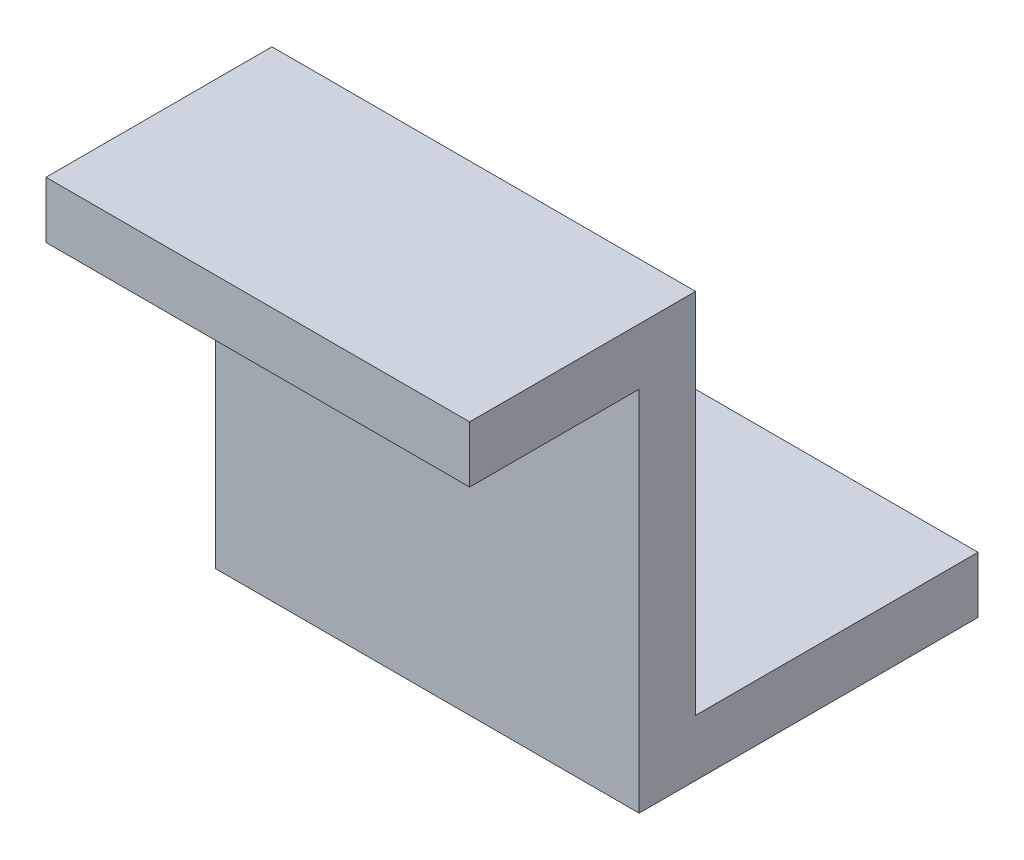
ISO-10303-21;
HEADER;
FILE_DESCRIPTION(('STEP AP214'),'2;1');
FILE_NAME('part.step','',(''),(''),'','','');
FILE_SCHEMA(('AUTOMOTIVE_DESIGN { 1 0 10303 214 1 1 1 1 }'));
ENDSEC;
DATA;
#1=APPLICATION_CONTEXT('core data for automotive mechanical design processes');
#2=APPLICATION_PROTOCOL_DEFINITION('international standard','automotive_design',2000,#1);
#3=PRODUCT_CONTEXT('',#1,'mechanical');
#4=PRODUCT('Part','Part','',(#3));
#5=PRODUCT_RELATED_PRODUCT_CATEGORY('part','',(#4));
#6=PRODUCT_DEFINITION_FORMATION('','',#4);
#7=PRODUCT_DEFINITION_CONTEXT('part definition',#1,'design');
#8=PRODUCT_DEFINITION('design','',#6,#7);
#9=PRODUCT_DEFINITION_SHAPE('','',#8);
#10=(LENGTH_UNIT() NAMED_UNIT(*) SI_UNIT(.MILLI.,.METRE.));
#11=(NAMED_UNIT(*) PLANE_ANGLE_UNIT() SI_UNIT($,.RADIAN.));
#12=(NAMED_UNIT(*) SI_UNIT($,.STERADIAN.) SOLID_ANGLE_UNIT());
#13=UNCERTAINTY_MEASURE_WITH_UNIT(LENGTH_MEASURE(1.E-05),#10,'distance_accuracy_value','');
#14=(GEOMETRIC_REPRESENTATION_CONTEXT(3) GLOBAL_UNCERTAINTY_ASSIGNED_CONTEXT((#13)) GLOBAL_UNIT_ASSIGNED_CONTEXT((#10,
#11,#12)) REPRESENTATION_CONTEXT('',''));
#15=CARTESIAN_POINT('',(0.,0.,0.));
#16=DIRECTION('',(0.,0.,1.));
#17=DIRECTION('',(1.,0.,0.));
#18=AXIS2_PLACEMENT_3D('',#15,#16,#17);
#19=CARTESIAN_POINT('',(-15.,-2.,0.));
#20=DIRECTION('',(0.,0.,1.));
#21=DIRECTION('',(1.,0.,0.));
#22=AXIS2_PLACEMENT_3D('',#19,#20,#21);
#23=PLANE('',#22);
#24=DIRECTION('',(0.,-1.,0.));
#25=VECTOR('',#24,1.);
#26=CARTESIAN_POINT('',(0.,-2.,0.));
#27=LINE('',#26,#25);
#28=CARTESIAN_POINT('',(0.,0.,0.));
#29=VERTEX_POINT('',#28);
#30=CARTESIAN_POINT('',(0.,-2.,0.));
#31=VERTEX_POINT('',#30);
#32=EDGE_CURVE('E130',#29,#31,#27,.T.);
#33=ORIENTED_EDGE('',*,*,#32,.F.);
#34=DIRECTION('',(1.,0.,0.));
#35=VECTOR('',#34,1.);
#36=CARTESIAN_POINT('',(-15.,0.,0.));
#37=LINE('',#36,#35);
#38=CARTESIAN_POINT('',(-15.,0.,0.));
#39=VERTEX_POINT('',#38);
#40=EDGE_CURVE('E11',#39,#29,#37,.T.);
#41=ORIENTED_EDGE('',*,*,#40,.F.);
#42=DIRECTION('',(0.,-1.,0.));
#43=VECTOR('',#42,1.);
#44=CARTESIAN_POINT('',(-15.,-2.,0.));
#45=LINE('',#44,#43);
#46=CARTESIAN_POINT('',(-15.,-2.,0.));
#47=VERTEX_POINT('',#46);
#48=EDGE_CURVE('E151',#39,#47,#45,.T.);
#49=ORIENTED_EDGE('',*,*,#48,.T.);
#50=DIRECTION('',(1.,0.,0.));
#51=VECTOR('',#50,1.);
#52=CARTESIAN_POINT('',(-15.,-2.,0.));
#53=LINE('',#52,#51);
#54=EDGE_CURVE('E36',#47,#31,#53,.T.);
#55=ORIENTED_EDGE('',*,*,#54,.T.);
#56=EDGE_LOOP('',(#33,#41,#49,#55));
#57=FACE_BOUND('',#56,.T.);
#58=ADVANCED_FACE('F33',(#57),#23,.T.);
#59=CARTESIAN_POINT('',(-15.,0.,0.));
#60=DIRECTION('',(0.,1.,0.));
#61=DIRECTION('',(0.,0.,1.));
#62=AXIS2_PLACEMENT_3D('',#59,#60,#61);
#63=PLANE('',#62);
#64=DIRECTION('',(0.,0.,1.));
#65=VECTOR('',#64,1.);
#66=CARTESIAN_POINT('',(0.,0.,0.));
#67=LINE('',#66,#65);
#68=CARTESIAN_POINT('',(0.,0.,-8.));
#69=VERTEX_POINT('',#68);
#70=EDGE_CURVE('E149',#69,#29,#67,.T.);
#71=ORIENTED_EDGE('',*,*,#70,.F.);
#72=DIRECTION('',(1.,0.,0.));
#73=VECTOR('',#72,1.);
#74=CARTESIAN_POINT('',(-15.,0.,-8.));
#75=LINE('',#74,#73);
#76=CARTESIAN_POINT('',(-15.,0.,-8.));
#77=VERTEX_POINT('',#76);
#78=EDGE_CURVE('E42',#77,#69,#75,.T.);
#79=ORIENTED_EDGE('',*,*,#78,.F.);
#80=DIRECTION('',(0.,0.,1.));
#81=VECTOR('',#80,1.);
#82=CARTESIAN_POINT('',(-15.,0.,0.));
#83=LINE('',#82,#81);
#84=EDGE_CURVE('E120',#77,#39,#83,.T.);
#85=ORIENTED_EDGE('',*,*,#84,.T.);
#86=ORIENTED_EDGE('',*,*,#40,.T.);
#87=EDGE_LOOP('',(#71,#79,#85,#86));
#88=FACE_BOUND('',#87,.T.);
#89=ADVANCED_FACE('F163',(#88),#63,.T.);
#90=CARTESIAN_POINT('',(-15.,0.,-8.));
#91=DIRECTION('',(0.,0.,-1.));
#92=DIRECTION('',(0.,1.,0.));
#93=AXIS2_PLACEMENT_3D('',#90,#91,#92);
#94=PLANE('',#93);
#95=DIRECTION('',(0.,1.,0.));
#96=VECTOR('',#95,1.);
#97=CARTESIAN_POINT('',(0.,0.,-8.));
#98=LINE('',#97,#96);
#99=CARTESIAN_POINT('',(0.,-13.,-8.));
#100=VERTEX_POINT('',#99);
#101=EDGE_CURVE('E107',#100,#69,#98,.T.);
#102=ORIENTED_EDGE('',*,*,#101,.F.);
#103=DIRECTION('',(1.,0.,0.));
#104=VECTOR('',#103,1.);
#105=CARTESIAN_POINT('',(-15.,-13.,-8.));
#106=LINE('',#105,#104);
#107=CARTESIAN_POINT('',(-15.,-13.,-8.));
#108=VERTEX_POINT('',#107);
#109=EDGE_CURVE('E102',#108,#100,#106,.T.);
#110=ORIENTED_EDGE('',*,*,#109,.F.);
#111=DIRECTION('',(0.,1.,0.));
#112=VECTOR('',#111,1.);
#113=CARTESIAN_POINT('',(-15.,0.,-8.));
#114=LINE('',#113,#112);
#115=EDGE_CURVE('E105',#108,#77,#114,.T.);
#116=ORIENTED_EDGE('',*,*,#115,.T.);
#117=ORIENTED_EDGE('',*,*,#78,.T.);
#118=EDGE_LOOP('',(#102,#110,#116,#117));
#119=FACE_BOUND('',#118,.T.);
#120=ADVANCED_FACE('F104',(#119),#94,.T.);
#121=CARTESIAN_POINT('',(-15.,-13.,-8.));
#122=DIRECTION('',(0.,1.,0.));
#123=DIRECTION('',(0.,0.,1.));
#124=AXIS2_PLACEMENT_3D('',#121,#122,#123);
#125=PLANE('',#124);
#126=CARTESIAN_POINT('',(-7.5,-13.,-13.));
#127=DIRECTION('',(0.,1.,0.));
#128=DIRECTION('',(0.,0.,1.));
#129=AXIS2_PLACEMENT_3D('',#126,#127,#128);
#130=CIRCLE('',#129,1.5);
#131=CARTESIAN_POINT('',(-7.5,-13.,-11.5));
#132=VERTEX_POINT('',#131);
#133=EDGE_CURVE('E134',#132,#132,#130,.T.);
#134=ORIENTED_EDGE('',*,*,#133,.F.);
#135=EDGE_LOOP('',(#134));
#136=FACE_BOUND('',#135,.T.);
#137=DIRECTION('',(0.,0.,1.));
#138=VECTOR('',#137,1.);
#139=CARTESIAN_POINT('',(0.,-13.,-8.));
#140=LINE('',#139,#138);
#141=CARTESIAN_POINT('',(0.,-13.,-18.));
#142=VERTEX_POINT('',#141);
#143=EDGE_CURVE('E146',#142,#100,#140,.T.);
#144=ORIENTED_EDGE('',*,*,#143,.F.);
#145=DIRECTION('',(1.,0.,0.));
#146=VECTOR('',#145,1.);
#147=CARTESIAN_POINT('',(-15.,-13.,-18.));
#148=LINE('',#147,#146);
#149=CARTESIAN_POINT('',(-15.,-13.,-18.));
#150=VERTEX_POINT('',#149);
#151=EDGE_CURVE('E112',#150,#142,#148,.T.);
#152=ORIENTED_EDGE('',*,*,#151,.F.);
#153=DIRECTION('',(0.,0.,1.));
#154=VECTOR('',#153,1.);
#155=CARTESIAN_POINT('',(-15.,-13.,-8.));
#156=LINE('',#155,#154);
#157=EDGE_CURVE('E118',#150,#108,#156,.T.);
#158=ORIENTED_EDGE('',*,*,#157,.T.);
#159=ORIENTED_EDGE('',*,*,#109,.T.);
#160=EDGE_LOOP('',(#144,#152,#158,#159));
#161=FACE_BOUND('',#160,.T.);
#162=ADVANCED_FACE('F122',(#136,#161),#125,.T.);
#163=CARTESIAN_POINT('',(-15.,-13.,-18.));
#164=DIRECTION('',(0.,0.,-1.));
#165=DIRECTION('',(-1.,0.,0.));
#166=AXIS2_PLACEMENT_3D('',#163,#164,#165);
#167=PLANE('',#166);
#168=DIRECTION('',(0.,1.,0.));
#169=VECTOR('',#168,1.);
#170=CARTESIAN_POINT('',(0.,-13.,-18.));
#171=LINE('',#170,#169);
#172=CARTESIAN_POINT('',(0.,-15.,-18.));
#173=VERTEX_POINT('',#172);
#174=EDGE_CURVE('E143',#173,#142,#171,.T.);
#175=ORIENTED_EDGE('',*,*,#174,.F.);
#176=DIRECTION('',(1.,0.,0.));
#177=VECTOR('',#176,1.);
#178=CARTESIAN_POINT('',(-15.,-15.,-18.));
#179=LINE('',#178,#177);
#180=CARTESIAN_POINT('',(-15.,-15.,-18.));
#181=VERTEX_POINT('',#180);
#182=EDGE_CURVE('E155',#181,#173,#179,.T.);
#183=ORIENTED_EDGE('',*,*,#182,.F.);
#184=DIRECTION('',(0.,1.,0.));
#185=VECTOR('',#184,1.);
#186=CARTESIAN_POINT('',(-15.,-13.,-18.));
#187=LINE('',#186,#185);
#188=EDGE_CURVE('E123',#181,#150,#187,.T.);
#189=ORIENTED_EDGE('',*,*,#188,.T.);
#190=ORIENTED_EDGE('',*,*,#151,.T.);
#191=EDGE_LOOP('',(#175,#183,#189,#190));
#192=FACE_BOUND('',#191,.T.);
#193=ADVANCED_FACE('F176',(#192),#167,.T.);
#194=CARTESIAN_POINT('',(-15.,-15.,-18.));
#195=DIRECTION('',(0.,-1.,0.));
#196=DIRECTION('',(0.,0.,-1.));
#197=AXIS2_PLACEMENT_3D('',#194,#195,#196);
#198=PLANE('',#197);
#199=CARTESIAN_POINT('',(-7.5,-15.,-13.));
#200=DIRECTION('',(0.,-1.,0.));
#201=DIRECTION('',(0.,0.,-1.));
#202=AXIS2_PLACEMENT_3D('',#199,#200,#201);
#203=CIRCLE('',#202,1.5);
#204=CARTESIAN_POINT('',(-7.5,-15.,-14.5));
#205=VERTEX_POINT('',#204);
#206=EDGE_CURVE('E204',#205,#205,#203,.F.);
#207=ORIENTED_EDGE('',*,*,#206,.T.);
#208=EDGE_LOOP('',(#207));
#209=FACE_BOUND('',#208,.T.);
#210=DIRECTION('',(0.,0.,-1.));
#211=VECTOR('',#210,1.);
#212=CARTESIAN_POINT('',(0.,-15.,-18.));
#213=LINE('',#212,#211);
#214=CARTESIAN_POINT('',(0.,-15.,-6.));
#215=VERTEX_POINT('',#214);
#216=EDGE_CURVE('E140',#215,#173,#213,.T.);
#217=ORIENTED_EDGE('',*,*,#216,.F.);
#218=DIRECTION('',(1.,0.,0.));
#219=VECTOR('',#218,1.);
#220=CARTESIAN_POINT('',(-15.,-15.,-6.));
#221=LINE('',#220,#219);
#222=CARTESIAN_POINT('',(-15.,-15.,-6.));
#223=VERTEX_POINT('',#222);
#224=EDGE_CURVE('E157',#223,#215,#221,.T.);
#225=ORIENTED_EDGE('',*,*,#224,.F.);
#226=DIRECTION('',(0.,0.,-1.));
#227=VECTOR('',#226,1.);
#228=CARTESIAN_POINT('',(-15.,-15.,-18.));
#229=LINE('',#228,#227);
#230=EDGE_CURVE('E125',#223,#181,#229,.T.);
#231=ORIENTED_EDGE('',*,*,#230,.T.);
#232=ORIENTED_EDGE('',*,*,#182,.T.);
#233=EDGE_LOOP('',(#217,#225,#231,#232));
#234=FACE_BOUND('',#233,.T.);
#235=ADVANCED_FACE('F180',(#209,#234),#198,.T.);
#236=CARTESIAN_POINT('',(-15.,-15.,-6.));
#237=DIRECTION('',(0.,0.,1.));
#238=DIRECTION('',(1.,0.,0.));
#239=AXIS2_PLACEMENT_3D('',#236,#237,#238);
#240=PLANE('',#239);
#241=DIRECTION('',(0.,-1.,0.));
#242=VECTOR('',#241,1.);
#243=CARTESIAN_POINT('',(0.,-15.,-6.));
#244=LINE('',#243,#242);
#245=CARTESIAN_POINT('',(0.,-2.,-6.));
#246=VERTEX_POINT('',#245);
#247=EDGE_CURVE('E137',#246,#215,#244,.T.);
#248=ORIENTED_EDGE('',*,*,#247,.F.);
#249=DIRECTION('',(1.,0.,0.));
#250=VECTOR('',#249,1.);
#251=CARTESIAN_POINT('',(-15.,-2.,-6.));
#252=LINE('',#251,#250);
#253=CARTESIAN_POINT('',(-15.,-2.,-6.));
#254=VERTEX_POINT('',#253);
#255=EDGE_CURVE('E158',#254,#246,#252,.T.);
#256=ORIENTED_EDGE('',*,*,#255,.F.);
#257=DIRECTION('',(0.,-1.,0.));
#258=VECTOR('',#257,1.);
#259=CARTESIAN_POINT('',(-15.,-15.,-6.));
#260=LINE('',#259,#258);
#261=EDGE_CURVE('E213',#254,#223,#260,.T.);
#262=ORIENTED_EDGE('',*,*,#261,.T.);
#263=ORIENTED_EDGE('',*,*,#224,.T.);
#264=EDGE_LOOP('',(#248,#256,#262,#263));
#265=FACE_BOUND('',#264,.T.);
#266=ADVANCED_FACE('F184',(#265),#240,.T.);
#267=CARTESIAN_POINT('',(-15.,-2.,-6.));
#268=DIRECTION('',(0.,-1.,0.));
#269=DIRECTION('',(0.,0.,-1.));
#270=AXIS2_PLACEMENT_3D('',#267,#268,#269);
#271=PLANE('',#270);
#272=DIRECTION('',(0.,0.,-1.));
#273=VECTOR('',#272,1.);
#274=CARTESIAN_POINT('',(0.,-2.,-6.));
#275=LINE('',#274,#273);
#276=EDGE_CURVE('E133',#31,#246,#275,.T.);
#277=ORIENTED_EDGE('',*,*,#276,.F.);
#278=ORIENTED_EDGE('',*,*,#54,.F.);
#279=DIRECTION('',(0.,0.,-1.));
#280=VECTOR('',#279,1.);
#281=CARTESIAN_POINT('',(-15.,-2.,-6.));
#282=LINE('',#281,#280);
#283=EDGE_CURVE('E211',#47,#254,#282,.T.);
#284=ORIENTED_EDGE('',*,*,#283,.T.);
#285=ORIENTED_EDGE('',*,*,#255,.T.);
#286=EDGE_LOOP('',(#277,#278,#284,#285));
#287=FACE_BOUND('',#286,.T.);
#288=ADVANCED_FACE('F160',(#287),#271,.T.);
#289=CARTESIAN_POINT('',(-15.,0.,0.));
#290=DIRECTION('',(-1.,0.,0.));
#291=DIRECTION('',(0.,0.,1.));
#292=AXIS2_PLACEMENT_3D('',#289,#290,#291);
#293=PLANE('',#292);
#294=ORIENTED_EDGE('',*,*,#48,.F.);
#295=ORIENTED_EDGE('',*,*,#84,.F.);
#296=ORIENTED_EDGE('',*,*,#115,.F.);
#297=ORIENTED_EDGE('',*,*,#157,.F.);
#298=ORIENTED_EDGE('',*,*,#188,.F.);
#299=ORIENTED_EDGE('',*,*,#230,.F.);
#300=ORIENTED_EDGE('',*,*,#261,.F.);
#301=ORIENTED_EDGE('',*,*,#283,.F.);
#302=EDGE_LOOP('',(#294,#295,#296,#297,#298,#299,#300,#301));
#303=FACE_BOUND('',#302,.T.);
#304=ADVANCED_FACE('F116',(#303),#293,.T.);
#305=CARTESIAN_POINT('',(0.,0.,0.));
#306=DIRECTION('',(-1.,0.,0.));
#307=DIRECTION('',(0.,0.,1.));
#308=AXIS2_PLACEMENT_3D('',#305,#306,#307);
#309=PLANE('',#308);
#310=ORIENTED_EDGE('',*,*,#32,.T.);
#311=ORIENTED_EDGE('',*,*,#276,.T.);
#312=ORIENTED_EDGE('',*,*,#247,.T.);
#313=ORIENTED_EDGE('',*,*,#216,.T.);
#314=ORIENTED_EDGE('',*,*,#174,.T.);
#315=ORIENTED_EDGE('',*,*,#143,.T.);
#316=ORIENTED_EDGE('',*,*,#101,.T.);
#317=ORIENTED_EDGE('',*,*,#70,.T.);
#318=EDGE_LOOP('',(#310,#311,#312,#313,#314,#315,#316,#317));
#319=FACE_BOUND('',#318,.T.);
#320=ADVANCED_FACE('F162',(#319),#309,.F.);
#321=CARTESIAN_POINT('',(-7.5,-15.001,-13.));
#322=DIRECTION('',(0.,1.,0.));
#323=DIRECTION('',(0.,0.,1.));
#324=AXIS2_PLACEMENT_3D('',#321,#322,#323);
#325=CYLINDRICAL_SURFACE('',#324,1.5);
#326=ORIENTED_EDGE('',*,*,#206,.F.);
#327=EDGE_LOOP('',(#326));
#328=FACE_BOUND('',#327,.T.);
#329=ORIENTED_EDGE('',*,*,#133,.T.);
#330=EDGE_LOOP('',(#329));
#331=FACE_BOUND('',#330,.T.);
#332=ADVANCED_FACE('F195',(#328,#331),#325,.F.);
#333=CLOSED_SHELL('',(#58,#89,#120,#162,#193,#235,#266,#288,#304,#320,#332));
#334=MANIFOLD_SOLID_BREP('B2',#333);
#335=ADVANCED_BREP_SHAPE_REPRESENTATION('',(#18,#334),#14);
#336=SHAPE_DEFINITION_REPRESENTATION(#9,#335);
ENDSEC;
END-ISO-10303-21;
